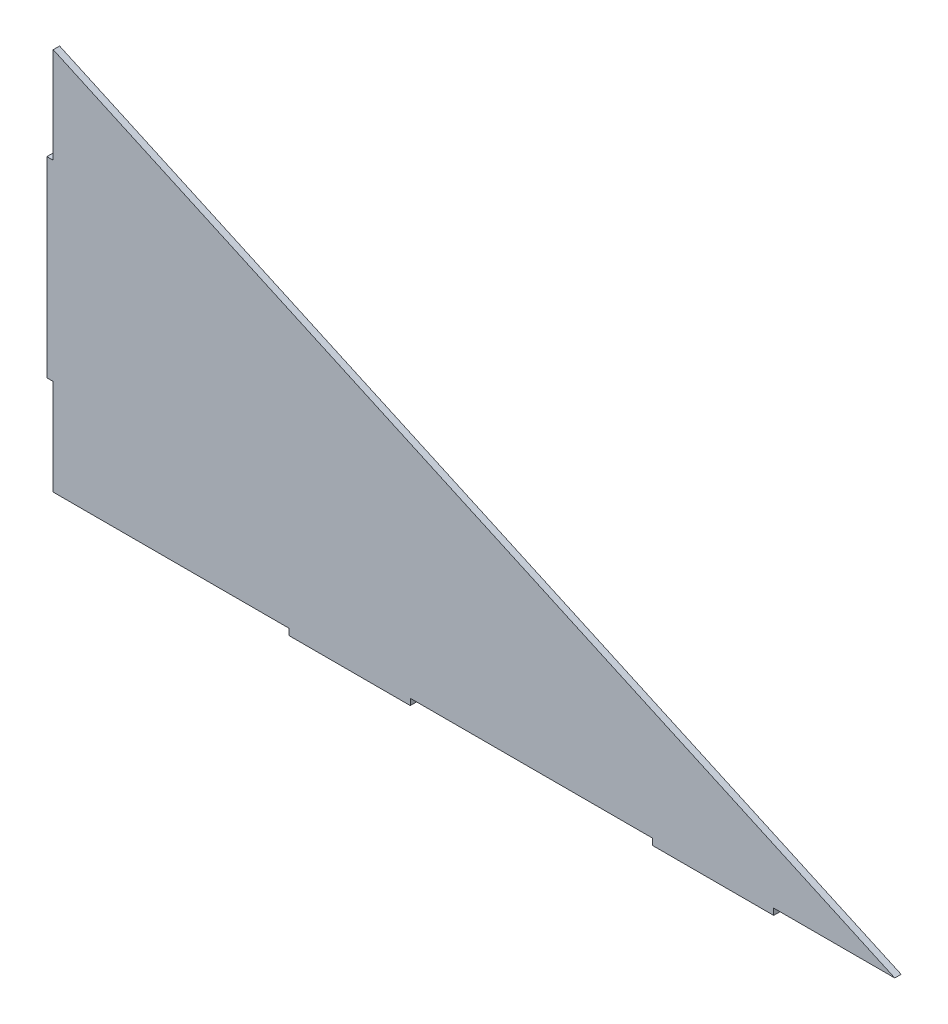
ISO-10303-21;
HEADER;
FILE_DESCRIPTION(('STEP AP214'),'2;1');
FILE_NAME('part.step','',(''),(''),'','','');
FILE_SCHEMA(('AUTOMOTIVE_DESIGN { 1 0 10303 214 1 1 1 1 }'));
ENDSEC;
DATA;
#1=APPLICATION_CONTEXT('core data for automotive mechanical design processes');
#2=APPLICATION_PROTOCOL_DEFINITION('international standard','automotive_design',2000,#1);
#3=PRODUCT_CONTEXT('',#1,'mechanical');
#4=PRODUCT('Part','Part','',(#3));
#5=PRODUCT_RELATED_PRODUCT_CATEGORY('part','',(#4));
#6=PRODUCT_DEFINITION_FORMATION('','',#4);
#7=PRODUCT_DEFINITION_CONTEXT('part definition',#1,'design');
#8=PRODUCT_DEFINITION('design','',#6,#7);
#9=PRODUCT_DEFINITION_SHAPE('','',#8);
#10=(LENGTH_UNIT() NAMED_UNIT(*) SI_UNIT(.MILLI.,.METRE.));
#11=(NAMED_UNIT(*) PLANE_ANGLE_UNIT() SI_UNIT($,.RADIAN.));
#12=(NAMED_UNIT(*) SI_UNIT($,.STERADIAN.) SOLID_ANGLE_UNIT());
#13=UNCERTAINTY_MEASURE_WITH_UNIT(LENGTH_MEASURE(1.E-05),#10,'distance_accuracy_value','');
#14=(GEOMETRIC_REPRESENTATION_CONTEXT(3) GLOBAL_UNCERTAINTY_ASSIGNED_CONTEXT((#13)) GLOBAL_UNIT_ASSIGNED_CONTEXT((#10,
#11,#12)) REPRESENTATION_CONTEXT('',''));
#15=CARTESIAN_POINT('',(0.,0.,0.));
#16=DIRECTION('',(0.,0.,1.));
#17=DIRECTION('',(1.,0.,0.));
#18=AXIS2_PLACEMENT_3D('',#15,#16,#17);
#19=CARTESIAN_POINT('',(111.28571425,0.,3.));
#20=DIRECTION('',(0.,1.,0.));
#21=DIRECTION('',(-1.,0.,0.));
#22=AXIS2_PLACEMENT_3D('',#19,#20,#21);
#23=PLANE('',#22);
#24=DIRECTION('',(1.,0.,0.));
#25=VECTOR('',#24,1.);
#26=CARTESIAN_POINT('',(111.28571425,0.,0.));
#27=LINE('',#26,#25);
#28=CARTESIAN_POINT('',(0.,0.,0.));
#29=VERTEX_POINT('',#28);
#30=CARTESIAN_POINT('',(111.28571425,0.,0.));
#31=VERTEX_POINT('',#30);
#32=EDGE_CURVE('E171',#29,#31,#27,.T.);
#33=ORIENTED_EDGE('',*,*,#32,.T.);
#34=DIRECTION('',(0.,0.,-1.));
#35=VECTOR('',#34,1.);
#36=CARTESIAN_POINT('',(111.28571425,0.,3.));
#37=LINE('',#36,#35);
#38=CARTESIAN_POINT('',(111.28571425,0.,3.));
#39=VERTEX_POINT('',#38);
#40=EDGE_CURVE('E11',#39,#31,#37,.T.);
#41=ORIENTED_EDGE('',*,*,#40,.F.);
#42=DIRECTION('',(1.,0.,0.));
#43=VECTOR('',#42,1.);
#44=CARTESIAN_POINT('',(111.28571425,0.,3.));
#45=LINE('',#44,#43);
#46=CARTESIAN_POINT('',(0.,0.,3.));
#47=VERTEX_POINT('',#46);
#48=EDGE_CURVE('E199',#47,#39,#45,.T.);
#49=ORIENTED_EDGE('',*,*,#48,.F.);
#50=DIRECTION('',(0.,0.,-1.));
#51=VECTOR('',#50,1.);
#52=CARTESIAN_POINT('',(0.,0.,3.));
#53=LINE('',#52,#51);
#54=EDGE_CURVE('E167',#47,#29,#53,.T.);
#55=ORIENTED_EDGE('',*,*,#54,.T.);
#56=EDGE_LOOP('',(#33,#41,#49,#55));
#57=FACE_BOUND('',#56,.T.);
#58=ADVANCED_FACE('F33',(#57),#23,.F.);
#59=CARTESIAN_POINT('',(111.28571425,0.,3.));
#60=DIRECTION('',(1.,0.,0.));
#61=DIRECTION('',(0.,0.,-1.));
#62=AXIS2_PLACEMENT_3D('',#59,#60,#61);
#63=PLANE('',#62);
#64=DIRECTION('',(0.,-1.,0.));
#65=VECTOR('',#64,1.);
#66=CARTESIAN_POINT('',(111.28571425,0.,0.));
#67=LINE('',#66,#65);
#68=CARTESIAN_POINT('',(111.28571425,-3.00000000000002,0.));
#69=VERTEX_POINT('',#68);
#70=EDGE_CURVE('E174',#31,#69,#67,.T.);
#71=ORIENTED_EDGE('',*,*,#70,.T.);
#72=DIRECTION('',(0.,0.,-1.));
#73=VECTOR('',#72,1.);
#74=CARTESIAN_POINT('',(111.28571425,-3.00000000000002,3.));
#75=LINE('',#74,#73);
#76=CARTESIAN_POINT('',(111.28571425,-3.00000000000002,3.));
#77=VERTEX_POINT('',#76);
#78=EDGE_CURVE('E41',#77,#69,#75,.T.);
#79=ORIENTED_EDGE('',*,*,#78,.F.);
#80=DIRECTION('',(0.,-1.,0.));
#81=VECTOR('',#80,1.);
#82=CARTESIAN_POINT('',(111.28571425,0.,3.));
#83=LINE('',#82,#81);
#84=EDGE_CURVE('E113',#39,#77,#83,.T.);
#85=ORIENTED_EDGE('',*,*,#84,.F.);
#86=ORIENTED_EDGE('',*,*,#40,.T.);
#87=EDGE_LOOP('',(#71,#79,#85,#86));
#88=FACE_BOUND('',#87,.T.);
#89=ADVANCED_FACE('F292',(#88),#63,.F.);
#90=CARTESIAN_POINT('',(168.4285714,-3.00000000000001,3.));
#91=DIRECTION('',(0.,1.,0.));
#92=DIRECTION('',(-1.,0.,0.));
#93=AXIS2_PLACEMENT_3D('',#90,#91,#92);
#94=PLANE('',#93);
#95=DIRECTION('',(1.,0.,0.));
#96=VECTOR('',#95,1.);
#97=CARTESIAN_POINT('',(168.4285714,-3.00000000000001,0.));
#98=LINE('',#97,#96);
#99=CARTESIAN_POINT('',(168.4285714,-3.00000000000001,0.));
#100=VERTEX_POINT('',#99);
#101=EDGE_CURVE('E176',#69,#100,#98,.T.);
#102=ORIENTED_EDGE('',*,*,#101,.T.);
#103=DIRECTION('',(0.,0.,-1.));
#104=VECTOR('',#103,1.);
#105=CARTESIAN_POINT('',(168.4285714,-3.00000000000001,3.));
#106=LINE('',#105,#104);
#107=CARTESIAN_POINT('',(168.4285714,-3.00000000000001,3.));
#108=VERTEX_POINT('',#107);
#109=EDGE_CURVE('E227',#108,#100,#106,.T.);
#110=ORIENTED_EDGE('',*,*,#109,.F.);
#111=DIRECTION('',(1.,0.,0.));
#112=VECTOR('',#111,1.);
#113=CARTESIAN_POINT('',(168.4285714,-3.00000000000001,3.));
#114=LINE('',#113,#112);
#115=EDGE_CURVE('E235',#77,#108,#114,.T.);
#116=ORIENTED_EDGE('',*,*,#115,.F.);
#117=ORIENTED_EDGE('',*,*,#78,.T.);
#118=EDGE_LOOP('',(#102,#110,#116,#117));
#119=FACE_BOUND('',#118,.T.);
#120=ADVANCED_FACE('F233',(#119),#94,.F.);
#121=CARTESIAN_POINT('',(168.4285714,0.,3.));
#122=DIRECTION('',(-1.,0.,0.));
#123=DIRECTION('',(0.,0.,1.));
#124=AXIS2_PLACEMENT_3D('',#121,#122,#123);
#125=PLANE('',#124);
#126=DIRECTION('',(0.,1.,0.));
#127=VECTOR('',#126,1.);
#128=CARTESIAN_POINT('',(168.4285714,0.,0.));
#129=LINE('',#128,#127);
#130=CARTESIAN_POINT('',(168.4285714,0.,0.));
#131=VERTEX_POINT('',#130);
#132=EDGE_CURVE('E178',#100,#131,#129,.T.);
#133=ORIENTED_EDGE('',*,*,#132,.T.);
#134=DIRECTION('',(0.,0.,-1.));
#135=VECTOR('',#134,1.);
#136=CARTESIAN_POINT('',(168.4285714,0.,3.));
#137=LINE('',#136,#135);
#138=CARTESIAN_POINT('',(168.4285714,0.,3.));
#139=VERTEX_POINT('',#138);
#140=EDGE_CURVE('E224',#139,#131,#137,.T.);
#141=ORIENTED_EDGE('',*,*,#140,.F.);
#142=DIRECTION('',(0.,1.,0.));
#143=VECTOR('',#142,1.);
#144=CARTESIAN_POINT('',(168.4285714,0.,3.));
#145=LINE('',#144,#143);
#146=EDGE_CURVE('E253',#108,#139,#145,.T.);
#147=ORIENTED_EDGE('',*,*,#146,.F.);
#148=ORIENTED_EDGE('',*,*,#109,.T.);
#149=EDGE_LOOP('',(#133,#141,#147,#148));
#150=FACE_BOUND('',#149,.T.);
#151=ADVANCED_FACE('F244',(#150),#125,.F.);
#152=CARTESIAN_POINT('',(282.7142857,0.,3.));
#153=DIRECTION('',(0.,1.,0.));
#154=DIRECTION('',(-1.,0.,0.));
#155=AXIS2_PLACEMENT_3D('',#152,#153,#154);
#156=PLANE('',#155);
#157=DIRECTION('',(1.,0.,0.));
#158=VECTOR('',#157,1.);
#159=CARTESIAN_POINT('',(282.7142857,0.,0.));
#160=LINE('',#159,#158);
#161=CARTESIAN_POINT('',(282.7142857,0.,0.));
#162=VERTEX_POINT('',#161);
#163=EDGE_CURVE('E180',#131,#162,#160,.T.);
#164=ORIENTED_EDGE('',*,*,#163,.T.);
#165=DIRECTION('',(0.,0.,-1.));
#166=VECTOR('',#165,1.);
#167=CARTESIAN_POINT('',(282.7142857,0.,3.));
#168=LINE('',#167,#166);
#169=CARTESIAN_POINT('',(282.7142857,0.,3.));
#170=VERTEX_POINT('',#169);
#171=EDGE_CURVE('E221',#170,#162,#168,.T.);
#172=ORIENTED_EDGE('',*,*,#171,.F.);
#173=DIRECTION('',(1.,0.,0.));
#174=VECTOR('',#173,1.);
#175=CARTESIAN_POINT('',(282.7142857,0.,3.));
#176=LINE('',#175,#174);
#177=EDGE_CURVE('E250',#139,#170,#176,.T.);
#178=ORIENTED_EDGE('',*,*,#177,.F.);
#179=ORIENTED_EDGE('',*,*,#140,.T.);
#180=EDGE_LOOP('',(#164,#172,#178,#179));
#181=FACE_BOUND('',#180,.T.);
#182=ADVANCED_FACE('F248',(#181),#156,.F.);
#183=CARTESIAN_POINT('',(282.7142857,0.,3.));
#184=DIRECTION('',(1.,0.,0.));
#185=DIRECTION('',(0.,0.,-1.));
#186=AXIS2_PLACEMENT_3D('',#183,#184,#185);
#187=PLANE('',#186);
#188=DIRECTION('',(0.,-1.,0.));
#189=VECTOR('',#188,1.);
#190=CARTESIAN_POINT('',(282.7142857,0.,0.));
#191=LINE('',#190,#189);
#192=CARTESIAN_POINT('',(282.7142857,-3.00000000000001,0.));
#193=VERTEX_POINT('',#192);
#194=EDGE_CURVE('E182',#162,#193,#191,.T.);
#195=ORIENTED_EDGE('',*,*,#194,.T.);
#196=DIRECTION('',(0.,0.,-1.));
#197=VECTOR('',#196,1.);
#198=CARTESIAN_POINT('',(282.7142857,-3.00000000000001,3.));
#199=LINE('',#198,#197);
#200=CARTESIAN_POINT('',(282.7142857,-3.00000000000001,3.));
#201=VERTEX_POINT('',#200);
#202=EDGE_CURVE('E218',#201,#193,#199,.T.);
#203=ORIENTED_EDGE('',*,*,#202,.F.);
#204=DIRECTION('',(0.,-1.,0.));
#205=VECTOR('',#204,1.);
#206=CARTESIAN_POINT('',(282.7142857,0.,3.));
#207=LINE('',#206,#205);
#208=EDGE_CURVE('E252',#170,#201,#207,.T.);
#209=ORIENTED_EDGE('',*,*,#208,.F.);
#210=ORIENTED_EDGE('',*,*,#171,.T.);
#211=EDGE_LOOP('',(#195,#203,#209,#210));
#212=FACE_BOUND('',#211,.T.);
#213=ADVANCED_FACE('F305',(#212),#187,.F.);
#214=CARTESIAN_POINT('',(282.7142857,-3.00000000000001,3.));
#215=DIRECTION('',(0.,1.,0.));
#216=DIRECTION('',(0.,0.,1.));
#217=AXIS2_PLACEMENT_3D('',#214,#215,#216);
#218=PLANE('',#217);
#219=DIRECTION('',(1.,0.,0.));
#220=VECTOR('',#219,1.);
#221=CARTESIAN_POINT('',(282.7142857,-3.00000000000001,0.));
#222=LINE('',#221,#220);
#223=CARTESIAN_POINT('',(339.85714285,-3.00000000000001,0.));
#224=VERTEX_POINT('',#223);
#225=EDGE_CURVE('E184',#193,#224,#222,.T.);
#226=ORIENTED_EDGE('',*,*,#225,.T.);
#227=DIRECTION('',(0.,0.,-1.));
#228=VECTOR('',#227,1.);
#229=CARTESIAN_POINT('',(339.85714285,-3.00000000000001,3.));
#230=LINE('',#229,#228);
#231=CARTESIAN_POINT('',(339.85714285,-3.00000000000001,3.));
#232=VERTEX_POINT('',#231);
#233=EDGE_CURVE('E215',#232,#224,#230,.T.);
#234=ORIENTED_EDGE('',*,*,#233,.F.);
#235=DIRECTION('',(1.,0.,0.));
#236=VECTOR('',#235,1.);
#237=CARTESIAN_POINT('',(282.7142857,-3.00000000000001,3.));
#238=LINE('',#237,#236);
#239=EDGE_CURVE('E255',#201,#232,#238,.T.);
#240=ORIENTED_EDGE('',*,*,#239,.F.);
#241=ORIENTED_EDGE('',*,*,#202,.T.);
#242=EDGE_LOOP('',(#226,#234,#240,#241));
#243=FACE_BOUND('',#242,.T.);
#244=ADVANCED_FACE('F308',(#243),#218,.F.);
#245=CARTESIAN_POINT('',(339.85714285,0.,3.));
#246=DIRECTION('',(-1.,0.,0.));
#247=DIRECTION('',(0.,0.,1.));
#248=AXIS2_PLACEMENT_3D('',#245,#246,#247);
#249=PLANE('',#248);
#250=DIRECTION('',(0.,1.,0.));
#251=VECTOR('',#250,1.);
#252=CARTESIAN_POINT('',(339.85714285,0.,0.));
#253=LINE('',#252,#251);
#254=CARTESIAN_POINT('',(339.85714285,0.,0.));
#255=VERTEX_POINT('',#254);
#256=EDGE_CURVE('E186',#224,#255,#253,.T.);
#257=ORIENTED_EDGE('',*,*,#256,.T.);
#258=DIRECTION('',(0.,0.,-1.));
#259=VECTOR('',#258,1.);
#260=CARTESIAN_POINT('',(339.85714285,0.,3.));
#261=LINE('',#260,#259);
#262=CARTESIAN_POINT('',(339.85714285,0.,3.));
#263=VERTEX_POINT('',#262);
#264=EDGE_CURVE('E212',#263,#255,#261,.T.);
#265=ORIENTED_EDGE('',*,*,#264,.F.);
#266=DIRECTION('',(0.,1.,0.));
#267=VECTOR('',#266,1.);
#268=CARTESIAN_POINT('',(339.85714285,0.,3.));
#269=LINE('',#268,#267);
#270=EDGE_CURVE('E261',#232,#263,#269,.T.);
#271=ORIENTED_EDGE('',*,*,#270,.F.);
#272=ORIENTED_EDGE('',*,*,#233,.T.);
#273=EDGE_LOOP('',(#257,#265,#271,#272));
#274=FACE_BOUND('',#273,.T.);
#275=ADVANCED_FACE('F312',(#274),#249,.F.);
#276=CARTESIAN_POINT('',(397.,0.,3.));
#277=DIRECTION('',(0.,1.,0.));
#278=DIRECTION('',(-1.,0.,0.));
#279=AXIS2_PLACEMENT_3D('',#276,#277,#278);
#280=PLANE('',#279);
#281=DIRECTION('',(1.,0.,0.));
#282=VECTOR('',#281,1.);
#283=CARTESIAN_POINT('',(397.,0.,0.));
#284=LINE('',#283,#282);
#285=CARTESIAN_POINT('',(397.,0.,0.));
#286=VERTEX_POINT('',#285);
#287=EDGE_CURVE('E188',#255,#286,#284,.T.);
#288=ORIENTED_EDGE('',*,*,#287,.T.);
#289=DIRECTION('',(0.,0.,-1.));
#290=VECTOR('',#289,1.);
#291=CARTESIAN_POINT('',(397.,0.,3.));
#292=LINE('',#291,#290);
#293=CARTESIAN_POINT('',(397.,0.,3.));
#294=VERTEX_POINT('',#293);
#295=EDGE_CURVE('E209',#294,#286,#292,.T.);
#296=ORIENTED_EDGE('',*,*,#295,.F.);
#297=DIRECTION('',(1.,0.,0.));
#298=VECTOR('',#297,1.);
#299=CARTESIAN_POINT('',(397.,0.,3.));
#300=LINE('',#299,#298);
#301=EDGE_CURVE('E263',#263,#294,#300,.T.);
#302=ORIENTED_EDGE('',*,*,#301,.F.);
#303=ORIENTED_EDGE('',*,*,#264,.T.);
#304=EDGE_LOOP('',(#288,#296,#302,#303));
#305=FACE_BOUND('',#304,.T.);
#306=ADVANCED_FACE('F316',(#305),#280,.F.);
#307=CARTESIAN_POINT('',(0.,180.76244654,3.));
#308=DIRECTION('',(-0.414387840903105,-0.910100388589997,0.));
#309=DIRECTION('',(0.910100388589997,-0.414387840903105,0.));
#310=AXIS2_PLACEMENT_3D('',#307,#308,#309);
#311=PLANE('',#310);
#312=DIRECTION('',(-0.910100388589997,0.414387840903105,0.));
#313=VECTOR('',#312,1.);
#314=CARTESIAN_POINT('',(0.,180.76244654,0.));
#315=LINE('',#314,#313);
#316=CARTESIAN_POINT('',(0.,180.76244654,0.));
#317=VERTEX_POINT('',#316);
#318=EDGE_CURVE('E190',#286,#317,#315,.T.);
#319=ORIENTED_EDGE('',*,*,#318,.T.);
#320=DIRECTION('',(0.,0.,-1.));
#321=VECTOR('',#320,1.);
#322=CARTESIAN_POINT('',(0.,180.76244654,3.));
#323=LINE('',#322,#321);
#324=CARTESIAN_POINT('',(0.,180.76244654,3.));
#325=VERTEX_POINT('',#324);
#326=EDGE_CURVE('E206',#325,#317,#323,.T.);
#327=ORIENTED_EDGE('',*,*,#326,.F.);
#328=DIRECTION('',(-0.910100388589997,0.414387840903105,0.));
#329=VECTOR('',#328,1.);
#330=CARTESIAN_POINT('',(0.,180.76244654,3.));
#331=LINE('',#330,#329);
#332=EDGE_CURVE('E265',#294,#325,#331,.T.);
#333=ORIENTED_EDGE('',*,*,#332,.F.);
#334=ORIENTED_EDGE('',*,*,#295,.T.);
#335=EDGE_LOOP('',(#319,#327,#333,#334));
#336=FACE_BOUND('',#335,.T.);
#337=ADVANCED_FACE('F320',(#336),#311,.F.);
#338=CARTESIAN_POINT('',(0.,135.571834905,3.));
#339=DIRECTION('',(1.,0.,0.));
#340=DIRECTION('',(0.,1.,0.));
#341=AXIS2_PLACEMENT_3D('',#338,#339,#340);
#342=PLANE('',#341);
#343=DIRECTION('',(0.,-1.,0.));
#344=VECTOR('',#343,1.);
#345=CARTESIAN_POINT('',(0.,135.571834905,0.));
#346=LINE('',#345,#344);
#347=CARTESIAN_POINT('',(0.,135.571834905,0.));
#348=VERTEX_POINT('',#347);
#349=EDGE_CURVE('E192',#317,#348,#346,.T.);
#350=ORIENTED_EDGE('',*,*,#349,.T.);
#351=DIRECTION('',(0.,0.,-1.));
#352=VECTOR('',#351,1.);
#353=CARTESIAN_POINT('',(0.,135.571834905,3.));
#354=LINE('',#353,#352);
#355=CARTESIAN_POINT('',(0.,135.571834905,3.));
#356=VERTEX_POINT('',#355);
#357=EDGE_CURVE('E203',#356,#348,#354,.T.);
#358=ORIENTED_EDGE('',*,*,#357,.F.);
#359=DIRECTION('',(0.,-1.,0.));
#360=VECTOR('',#359,1.);
#361=CARTESIAN_POINT('',(0.,135.571834905,3.));
#362=LINE('',#361,#360);
#363=EDGE_CURVE('E267',#325,#356,#362,.T.);
#364=ORIENTED_EDGE('',*,*,#363,.F.);
#365=ORIENTED_EDGE('',*,*,#326,.T.);
#366=EDGE_LOOP('',(#350,#358,#364,#365));
#367=FACE_BOUND('',#366,.T.);
#368=ADVANCED_FACE('F273',(#367),#342,.F.);
#369=CARTESIAN_POINT('',(0.,135.571834905,3.));
#370=DIRECTION('',(0.,-1.,0.));
#371=DIRECTION('',(0.,0.,-1.));
#372=AXIS2_PLACEMENT_3D('',#369,#370,#371);
#373=PLANE('',#372);
#374=DIRECTION('',(-1.,0.,0.));
#375=VECTOR('',#374,1.);
#376=CARTESIAN_POINT('',(0.,135.571834905,0.));
#377=LINE('',#376,#375);
#378=CARTESIAN_POINT('',(-3.,135.571834905,0.));
#379=VERTEX_POINT('',#378);
#380=EDGE_CURVE('E194',#348,#379,#377,.T.);
#381=ORIENTED_EDGE('',*,*,#380,.T.);
#382=DIRECTION('',(0.,0.,-1.));
#383=VECTOR('',#382,1.);
#384=CARTESIAN_POINT('',(-3.,135.571834905,3.));
#385=LINE('',#384,#383);
#386=CARTESIAN_POINT('',(-3.,135.571834905,3.));
#387=VERTEX_POINT('',#386);
#388=EDGE_CURVE('E162',#387,#379,#385,.T.);
#389=ORIENTED_EDGE('',*,*,#388,.F.);
#390=DIRECTION('',(-1.,0.,0.));
#391=VECTOR('',#390,1.);
#392=CARTESIAN_POINT('',(0.,135.571834905,3.));
#393=LINE('',#392,#391);
#394=EDGE_CURVE('E153',#356,#387,#393,.T.);
#395=ORIENTED_EDGE('',*,*,#394,.F.);
#396=ORIENTED_EDGE('',*,*,#357,.T.);
#397=EDGE_LOOP('',(#381,#389,#395,#396));
#398=FACE_BOUND('',#397,.T.);
#399=ADVANCED_FACE('F277',(#398),#373,.F.);
#400=CARTESIAN_POINT('',(-3.,135.571834905,3.));
#401=DIRECTION('',(1.,0.,0.));
#402=DIRECTION('',(0.,1.,0.));
#403=AXIS2_PLACEMENT_3D('',#400,#401,#402);
#404=PLANE('',#403);
#405=DIRECTION('',(0.,-1.,0.));
#406=VECTOR('',#405,1.);
#407=CARTESIAN_POINT('',(-3.,135.571834905,0.));
#408=LINE('',#407,#406);
#409=CARTESIAN_POINT('',(-2.99999999999999,45.190611635,0.));
#410=VERTEX_POINT('',#409);
#411=EDGE_CURVE('E161',#379,#410,#408,.T.);
#412=ORIENTED_EDGE('',*,*,#411,.T.);
#413=DIRECTION('',(0.,0.,-1.));
#414=VECTOR('',#413,1.);
#415=CARTESIAN_POINT('',(-2.99999999999999,45.190611635,3.));
#416=LINE('',#415,#414);
#417=CARTESIAN_POINT('',(-2.99999999999999,45.190611635,3.));
#418=VERTEX_POINT('',#417);
#419=EDGE_CURVE('E158',#418,#410,#416,.T.);
#420=ORIENTED_EDGE('',*,*,#419,.F.);
#421=DIRECTION('',(0.,-1.,0.));
#422=VECTOR('',#421,1.);
#423=CARTESIAN_POINT('',(-3.,135.571834905,3.));
#424=LINE('',#423,#422);
#425=EDGE_CURVE('E147',#387,#418,#424,.T.);
#426=ORIENTED_EDGE('',*,*,#425,.F.);
#427=ORIENTED_EDGE('',*,*,#388,.T.);
#428=EDGE_LOOP('',(#412,#420,#426,#427));
#429=FACE_BOUND('',#428,.T.);
#430=ADVANCED_FACE('F159',(#429),#404,.F.);
#431=CARTESIAN_POINT('',(0.,45.190611635,3.));
#432=DIRECTION('',(0.,1.,0.));
#433=DIRECTION('',(0.,0.,1.));
#434=AXIS2_PLACEMENT_3D('',#431,#432,#433);
#435=PLANE('',#434);
#436=DIRECTION('',(1.,0.,0.));
#437=VECTOR('',#436,1.);
#438=CARTESIAN_POINT('',(0.,45.190611635,0.));
#439=LINE('',#438,#437);
#440=CARTESIAN_POINT('',(0.,45.190611635,0.));
#441=VERTEX_POINT('',#440);
#442=EDGE_CURVE('E99',#410,#441,#439,.T.);
#443=ORIENTED_EDGE('',*,*,#442,.T.);
#444=DIRECTION('',(0.,0.,-1.));
#445=VECTOR('',#444,1.);
#446=CARTESIAN_POINT('',(0.,45.190611635,3.));
#447=LINE('',#446,#445);
#448=CARTESIAN_POINT('',(0.,45.190611635,3.));
#449=VERTEX_POINT('',#448);
#450=EDGE_CURVE('E163',#449,#441,#447,.T.);
#451=ORIENTED_EDGE('',*,*,#450,.F.);
#452=DIRECTION('',(1.,0.,0.));
#453=VECTOR('',#452,1.);
#454=CARTESIAN_POINT('',(0.,45.190611635,3.));
#455=LINE('',#454,#453);
#456=EDGE_CURVE('E151',#418,#449,#455,.T.);
#457=ORIENTED_EDGE('',*,*,#456,.F.);
#458=ORIENTED_EDGE('',*,*,#419,.T.);
#459=EDGE_LOOP('',(#443,#451,#457,#458));
#460=FACE_BOUND('',#459,.T.);
#461=ADVANCED_FACE('F165',(#460),#435,.F.);
#462=CARTESIAN_POINT('',(0.,0.,3.));
#463=DIRECTION('',(1.,0.,0.));
#464=DIRECTION('',(0.,1.,0.));
#465=AXIS2_PLACEMENT_3D('',#462,#463,#464);
#466=PLANE('',#465);
#467=DIRECTION('',(0.,-1.,0.));
#468=VECTOR('',#467,1.);
#469=CARTESIAN_POINT('',(0.,0.,0.));
#470=LINE('',#469,#468);
#471=EDGE_CURVE('E105',#441,#29,#470,.T.);
#472=ORIENTED_EDGE('',*,*,#471,.T.);
#473=ORIENTED_EDGE('',*,*,#54,.F.);
#474=DIRECTION('',(0.,-1.,0.));
#475=VECTOR('',#474,1.);
#476=CARTESIAN_POINT('',(0.,0.,3.));
#477=LINE('',#476,#475);
#478=EDGE_CURVE('E49',#449,#47,#477,.T.);
#479=ORIENTED_EDGE('',*,*,#478,.F.);
#480=ORIENTED_EDGE('',*,*,#450,.T.);
#481=EDGE_LOOP('',(#472,#473,#479,#480));
#482=FACE_BOUND('',#481,.T.);
#483=ADVANCED_FACE('F281',(#482),#466,.F.);
#484=CARTESIAN_POINT('',(0.,0.,3.));
#485=DIRECTION('',(0.,0.,-1.));
#486=DIRECTION('',(-1.,0.,0.));
#487=AXIS2_PLACEMENT_3D('',#484,#485,#486);
#488=PLANE('',#487);
#489=ORIENTED_EDGE('',*,*,#48,.T.);
#490=ORIENTED_EDGE('',*,*,#84,.T.);
#491=ORIENTED_EDGE('',*,*,#115,.T.);
#492=ORIENTED_EDGE('',*,*,#146,.T.);
#493=ORIENTED_EDGE('',*,*,#177,.T.);
#494=ORIENTED_EDGE('',*,*,#208,.T.);
#495=ORIENTED_EDGE('',*,*,#239,.T.);
#496=ORIENTED_EDGE('',*,*,#270,.T.);
#497=ORIENTED_EDGE('',*,*,#301,.T.);
#498=ORIENTED_EDGE('',*,*,#332,.T.);
#499=ORIENTED_EDGE('',*,*,#363,.T.);
#500=ORIENTED_EDGE('',*,*,#394,.T.);
#501=ORIENTED_EDGE('',*,*,#425,.T.);
#502=ORIENTED_EDGE('',*,*,#456,.T.);
#503=ORIENTED_EDGE('',*,*,#478,.T.);
#504=EDGE_LOOP('',(#489,#490,#491,#492,#493,#494,#495,#496,#497,#498,#499,#500,#501,#502,#503));
#505=FACE_BOUND('',#504,.T.);
#506=ADVANCED_FACE('F149',(#505),#488,.F.);
#507=CARTESIAN_POINT('',(0.,0.,0.));
#508=DIRECTION('',(0.,0.,-1.));
#509=DIRECTION('',(-1.,0.,0.));
#510=AXIS2_PLACEMENT_3D('',#507,#508,#509);
#511=PLANE('',#510);
#512=ORIENTED_EDGE('',*,*,#32,.F.);
#513=ORIENTED_EDGE('',*,*,#471,.F.);
#514=ORIENTED_EDGE('',*,*,#442,.F.);
#515=ORIENTED_EDGE('',*,*,#411,.F.);
#516=ORIENTED_EDGE('',*,*,#380,.F.);
#517=ORIENTED_EDGE('',*,*,#349,.F.);
#518=ORIENTED_EDGE('',*,*,#318,.F.);
#519=ORIENTED_EDGE('',*,*,#287,.F.);
#520=ORIENTED_EDGE('',*,*,#256,.F.);
#521=ORIENTED_EDGE('',*,*,#225,.F.);
#522=ORIENTED_EDGE('',*,*,#194,.F.);
#523=ORIENTED_EDGE('',*,*,#163,.F.);
#524=ORIENTED_EDGE('',*,*,#132,.F.);
#525=ORIENTED_EDGE('',*,*,#101,.F.);
#526=ORIENTED_EDGE('',*,*,#70,.F.);
#527=EDGE_LOOP('',(#512,#513,#514,#515,#516,#517,#518,#519,#520,#521,#522,#523,#524,#525,#526));
#528=FACE_BOUND('',#527,.T.);
#529=ADVANCED_FACE('F239',(#528),#511,.T.);
#530=CLOSED_SHELL('',(#58,#89,#120,#151,#182,#213,#244,#275,#306,#337,#368,#399,#430,#461,#483,
#506,#529));
#531=MANIFOLD_SOLID_BREP('B2',#530);
#532=ADVANCED_BREP_SHAPE_REPRESENTATION('',(#18,#531),#14);
#533=SHAPE_DEFINITION_REPRESENTATION(#9,#532);
ENDSEC;
END-ISO-10303-21;
